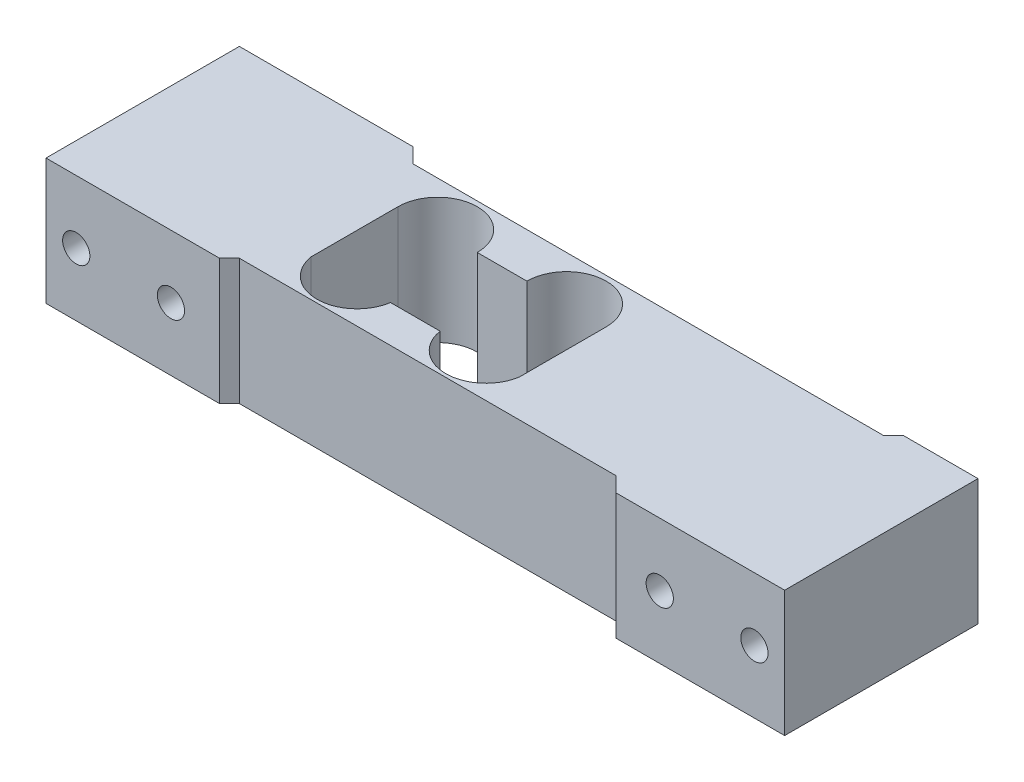
ISO-10303-21;
HEADER;
FILE_DESCRIPTION(('STEP AP214'),'2;1');
FILE_NAME('part.step','',(''),(''),'','','');
FILE_SCHEMA(('AUTOMOTIVE_DESIGN { 1 0 10303 214 1 1 1 1 }'));
ENDSEC;
DATA;
#1=APPLICATION_CONTEXT('core data for automotive mechanical design processes');
#2=APPLICATION_PROTOCOL_DEFINITION('international standard','automotive_design',2000,#1);
#3=PRODUCT_CONTEXT('',#1,'mechanical');
#4=PRODUCT('Part','Part','',(#3));
#5=PRODUCT_RELATED_PRODUCT_CATEGORY('part','',(#4));
#6=PRODUCT_DEFINITION_FORMATION('','',#4);
#7=PRODUCT_DEFINITION_CONTEXT('part definition',#1,'design');
#8=PRODUCT_DEFINITION('design','',#6,#7);
#9=PRODUCT_DEFINITION_SHAPE('','',#8);
#10=(LENGTH_UNIT() NAMED_UNIT(*) SI_UNIT(.MILLI.,.METRE.));
#11=(NAMED_UNIT(*) PLANE_ANGLE_UNIT() SI_UNIT($,.RADIAN.));
#12=(NAMED_UNIT(*) SI_UNIT($,.STERADIAN.) SOLID_ANGLE_UNIT());
#13=UNCERTAINTY_MEASURE_WITH_UNIT(LENGTH_MEASURE(1.E-05),#10,'distance_accuracy_value','');
#14=(GEOMETRIC_REPRESENTATION_CONTEXT(3) GLOBAL_UNCERTAINTY_ASSIGNED_CONTEXT((#13)) GLOBAL_UNIT_ASSIGNED_CONTEXT((#10,
#11,#12)) REPRESENTATION_CONTEXT('',''));
#15=CARTESIAN_POINT('',(0.,0.,0.));
#16=DIRECTION('',(0.,0.,1.));
#17=DIRECTION('',(1.,0.,0.));
#18=AXIS2_PLACEMENT_3D('',#15,#16,#17);
#19=CARTESIAN_POINT('',(-59.,12.7,9.05));
#20=DIRECTION('',(-1.,0.,0.));
#21=DIRECTION('',(0.,0.,1.));
#22=AXIS2_PLACEMENT_3D('',#19,#20,#21);
#23=CYLINDRICAL_SURFACE('',#22,2.75);
#24=CARTESIAN_POINT('',(-75.,12.7,9.05));
#25=DIRECTION('',(-1.,0.,0.));
#26=DIRECTION('',(0.,0.,1.));
#27=AXIS2_PLACEMENT_3D('',#24,#25,#26);
#28=CIRCLE('',#27,2.75);
#29=CARTESIAN_POINT('',(-75.,12.7,11.8));
#30=VERTEX_POINT('',#29);
#31=EDGE_CURVE('E386',#30,#30,#28,.T.);
#32=ORIENTED_EDGE('',*,*,#31,.T.);
#33=EDGE_LOOP('',(#32));
#34=FACE_BOUND('',#33,.T.);
#35=CARTESIAN_POINT('',(-68.9,12.7,9.05));
#36=DIRECTION('',(-0.707106781186547,0.,-0.707106781186547));
#37=DIRECTION('',(-0.707106781186547,0.,0.707106781186547));
#38=AXIS2_PLACEMENT_3D('',#35,#36,#37);
#39=ELLIPSE('',#38,3.88908729652602,2.75);
#40=CARTESIAN_POINT('',(-68.9,15.45,9.05));
#41=VERTEX_POINT('',#40);
#42=CARTESIAN_POINT('',(-68.9,9.95,9.05));
#43=VERTEX_POINT('',#42);
#44=EDGE_CURVE('E47',#41,#43,#39,.F.);
#45=ORIENTED_EDGE('',*,*,#44,.T.);
#46=CARTESIAN_POINT('',(-68.9,12.7,9.05));
#47=DIRECTION('',(-0.707106781186547,0.,0.707106781186547));
#48=DIRECTION('',(-0.707106781186547,0.,-0.707106781186547));
#49=AXIS2_PLACEMENT_3D('',#46,#47,#48);
#50=ELLIPSE('',#49,3.88908729652602,2.75);
#51=EDGE_CURVE('E11',#43,#41,#50,.F.);
#52=ORIENTED_EDGE('',*,*,#51,.T.);
#53=EDGE_LOOP('',(#45,#52));
#54=FACE_BOUND('',#53,.T.);
#55=ADVANCED_FACE('F34',(#34,#54),#23,.F.);
#56=CARTESIAN_POINT('',(-68.9,12.7,-4.));
#57=DIRECTION('',(0.,0.,-1.));
#58=DIRECTION('',(-1.,0.,0.));
#59=AXIS2_PLACEMENT_3D('',#56,#57,#58);
#60=CYLINDRICAL_SURFACE('',#59,2.75000000000001);
#61=CARTESIAN_POINT('',(-68.9,12.7,-20.));
#62=DIRECTION('',(0.,0.,-1.));
#63=DIRECTION('',(-1.,0.,0.));
#64=AXIS2_PLACEMENT_3D('',#61,#62,#63);
#65=CIRCLE('',#64,2.75000000000001);
#66=CARTESIAN_POINT('',(-71.65,12.7,-20.));
#67=VERTEX_POINT('',#66);
#68=EDGE_CURVE('E374',#67,#67,#65,.T.);
#69=ORIENTED_EDGE('',*,*,#68,.T.);
#70=EDGE_LOOP('',(#69));
#71=FACE_BOUND('',#70,.T.);
#72=CARTESIAN_POINT('',(-68.9,12.7,-10.05));
#73=DIRECTION('',(0.707106781186547,0.,-0.707106781186547));
#74=DIRECTION('',(-0.707106781186547,0.,-0.707106781186547));
#75=AXIS2_PLACEMENT_3D('',#72,#73,#74);
#76=ELLIPSE('',#75,3.88908729652602,2.75);
#77=CARTESIAN_POINT('',(-68.9,15.45,-10.05));
#78=VERTEX_POINT('',#77);
#79=CARTESIAN_POINT('',(-68.9,9.95,-10.05));
#80=VERTEX_POINT('',#79);
#81=EDGE_CURVE('E54',#78,#80,#76,.F.);
#82=ORIENTED_EDGE('',*,*,#81,.T.);
#83=CARTESIAN_POINT('',(-68.9,12.7,-10.05));
#84=DIRECTION('',(-0.707106781186547,0.,-0.707106781186547));
#85=DIRECTION('',(0.707106781186547,0.,-0.707106781186547));
#86=AXIS2_PLACEMENT_3D('',#83,#84,#85);
#87=ELLIPSE('',#86,3.88908729652602,2.75);
#88=EDGE_CURVE('E191',#80,#78,#87,.F.);
#89=ORIENTED_EDGE('',*,*,#88,.T.);
#90=EDGE_LOOP('',(#82,#89));
#91=FACE_BOUND('',#90,.T.);
#92=ADVANCED_FACE('F487',(#71,#91),#60,.F.);
#93=CARTESIAN_POINT('',(75.,25.4,-20.));
#94=DIRECTION('',(-1.,0.,0.));
#95=DIRECTION('',(0.,0.,1.));
#96=AXIS2_PLACEMENT_3D('',#93,#94,#95);
#97=PLANE('',#96);
#98=DIRECTION('',(0.,0.,-1.));
#99=VECTOR('',#98,1.);
#100=CARTESIAN_POINT('',(75.,0.,-20.));
#101=LINE('',#100,#99);
#102=CARTESIAN_POINT('',(75.,0.,20.));
#103=VERTEX_POINT('',#102);
#104=CARTESIAN_POINT('',(75.,0.,-19.));
#105=VERTEX_POINT('',#104);
#106=EDGE_CURVE('E263',#103,#105,#101,.T.);
#107=ORIENTED_EDGE('',*,*,#106,.T.);
#108=DIRECTION('',(0.,1.,0.));
#109=VECTOR('',#108,1.);
#110=CARTESIAN_POINT('',(75.,0.,-19.));
#111=LINE('',#110,#109);
#112=CARTESIAN_POINT('',(75.,25.4,-19.));
#113=VERTEX_POINT('',#112);
#114=EDGE_CURVE('E266',#105,#113,#111,.T.);
#115=ORIENTED_EDGE('',*,*,#114,.T.);
#116=DIRECTION('',(0.,0.,-1.));
#117=VECTOR('',#116,1.);
#118=CARTESIAN_POINT('',(75.,25.4,-20.));
#119=LINE('',#118,#117);
#120=CARTESIAN_POINT('',(75.,25.4,20.));
#121=VERTEX_POINT('',#120);
#122=EDGE_CURVE('E257',#121,#113,#119,.T.);
#123=ORIENTED_EDGE('',*,*,#122,.F.);
#124=DIRECTION('',(0.,-1.,0.));
#125=VECTOR('',#124,1.);
#126=CARTESIAN_POINT('',(75.,25.4,20.));
#127=LINE('',#126,#125);
#128=EDGE_CURVE('E251',#121,#103,#127,.T.);
#129=ORIENTED_EDGE('',*,*,#128,.T.);
#130=EDGE_LOOP('',(#107,#115,#123,#129));
#131=FACE_BOUND('',#130,.T.);
#132=ADVANCED_FACE('F474',(#131),#97,.F.);
#133=CARTESIAN_POINT('',(-75.,25.4,-20.));
#134=DIRECTION('',(0.,0.,1.));
#135=DIRECTION('',(1.,0.,0.));
#136=AXIS2_PLACEMENT_3D('',#133,#134,#135);
#137=PLANE('',#136);
#138=ORIENTED_EDGE('',*,*,#68,.F.);
#139=EDGE_LOOP('',(#138));
#140=FACE_BOUND('',#139,.T.);
#141=CARTESIAN_POINT('',(-49.8,12.7,-20.));
#142=DIRECTION('',(0.,0.,-1.));
#143=DIRECTION('',(-1.,0.,0.));
#144=AXIS2_PLACEMENT_3D('',#141,#142,#143);
#145=CIRCLE('',#144,2.75);
#146=CARTESIAN_POINT('',(-52.55,12.7,-20.));
#147=VERTEX_POINT('',#146);
#148=EDGE_CURVE('E367',#147,#147,#145,.T.);
#149=ORIENTED_EDGE('',*,*,#148,.F.);
#150=EDGE_LOOP('',(#149));
#151=FACE_BOUND('',#150,.T.);
#152=DIRECTION('',(-1.,0.,0.));
#153=VECTOR('',#152,1.);
#154=CARTESIAN_POINT('',(-75.,25.4,-20.));
#155=LINE('',#154,#153);
#156=CARTESIAN_POINT('',(-39.9999999999999,25.4,-20.));
#157=VERTEX_POINT('',#156);
#158=CARTESIAN_POINT('',(-75.,25.4,-20.));
#159=VERTEX_POINT('',#158);
#160=EDGE_CURVE('E271',#157,#159,#155,.T.);
#161=ORIENTED_EDGE('',*,*,#160,.F.);
#162=DIRECTION('',(0.,1.,0.));
#163=VECTOR('',#162,1.);
#164=CARTESIAN_POINT('',(-39.9999999999999,25.4,-20.));
#165=LINE('',#164,#163);
#166=CARTESIAN_POINT('',(-39.9999999999999,0.,-20.));
#167=VERTEX_POINT('',#166);
#168=EDGE_CURVE('E228',#157,#167,#165,.F.);
#169=ORIENTED_EDGE('',*,*,#168,.T.);
#170=DIRECTION('',(-1.,0.,0.));
#171=VECTOR('',#170,1.);
#172=CARTESIAN_POINT('',(-75.,0.,-20.));
#173=LINE('',#172,#171);
#174=CARTESIAN_POINT('',(-75.,0.,-20.));
#175=VERTEX_POINT('',#174);
#176=EDGE_CURVE('E261',#167,#175,#173,.T.);
#177=ORIENTED_EDGE('',*,*,#176,.T.);
#178=DIRECTION('',(0.,-1.,0.));
#179=VECTOR('',#178,1.);
#180=CARTESIAN_POINT('',(-75.,25.4,-20.));
#181=LINE('',#180,#179);
#182=EDGE_CURVE('E248',#159,#175,#181,.T.);
#183=ORIENTED_EDGE('',*,*,#182,.F.);
#184=EDGE_LOOP('',(#161,#169,#177,#183));
#185=FACE_BOUND('',#184,.T.);
#186=ADVANCED_FACE('F458',(#140,#151,#185),#137,.F.);
#187=CARTESIAN_POINT('',(-75.,25.4,-20.));
#188=DIRECTION('',(1.,0.,0.));
#189=DIRECTION('',(0.,0.,-1.));
#190=AXIS2_PLACEMENT_3D('',#187,#188,#189);
#191=PLANE('',#190);
#192=ORIENTED_EDGE('',*,*,#31,.F.);
#193=EDGE_LOOP('',(#192));
#194=FACE_BOUND('',#193,.T.);
#195=CARTESIAN_POINT('',(-75.,12.7,-10.05));
#196=DIRECTION('',(-1.,0.,0.));
#197=DIRECTION('',(0.,0.,1.));
#198=AXIS2_PLACEMENT_3D('',#195,#196,#197);
#199=CIRCLE('',#198,2.75);
#200=CARTESIAN_POINT('',(-75.,12.7,-7.3));
#201=VERTEX_POINT('',#200);
#202=EDGE_CURVE('E379',#201,#201,#199,.T.);
#203=ORIENTED_EDGE('',*,*,#202,.F.);
#204=EDGE_LOOP('',(#203));
#205=FACE_BOUND('',#204,.T.);
#206=DIRECTION('',(0.,0.,1.));
#207=VECTOR('',#206,1.);
#208=CARTESIAN_POINT('',(-75.,0.,-20.));
#209=LINE('',#208,#207);
#210=CARTESIAN_POINT('',(-75.,0.,19.));
#211=VERTEX_POINT('',#210);
#212=EDGE_CURVE('E258',#175,#211,#209,.T.);
#213=ORIENTED_EDGE('',*,*,#212,.T.);
#214=DIRECTION('',(0.,1.,0.));
#215=VECTOR('',#214,1.);
#216=CARTESIAN_POINT('',(-75.,0.,19.));
#217=LINE('',#216,#215);
#218=CARTESIAN_POINT('',(-75.,25.4,19.));
#219=VERTEX_POINT('',#218);
#220=EDGE_CURVE('E275',#211,#219,#217,.T.);
#221=ORIENTED_EDGE('',*,*,#220,.T.);
#222=DIRECTION('',(0.,0.,1.));
#223=VECTOR('',#222,1.);
#224=CARTESIAN_POINT('',(-75.,25.4,-20.));
#225=LINE('',#224,#223);
#226=EDGE_CURVE('E268',#159,#219,#225,.T.);
#227=ORIENTED_EDGE('',*,*,#226,.F.);
#228=ORIENTED_EDGE('',*,*,#182,.T.);
#229=EDGE_LOOP('',(#213,#221,#227,#228));
#230=FACE_BOUND('',#229,.T.);
#231=ADVANCED_FACE('F428',(#194,#205,#230),#191,.F.);
#232=CARTESIAN_POINT('',(-75.,25.4,20.));
#233=DIRECTION('',(0.,0.,-1.));
#234=DIRECTION('',(-1.,0.,0.));
#235=AXIS2_PLACEMENT_3D('',#232,#233,#234);
#236=PLANE('',#235);
#237=CARTESIAN_POINT('',(49.8,12.7,20.));
#238=DIRECTION('',(0.,0.,1.));
#239=DIRECTION('',(1.,0.,0.));
#240=AXIS2_PLACEMENT_3D('',#237,#238,#239);
#241=CIRCLE('',#240,2.75);
#242=CARTESIAN_POINT('',(52.55,12.7,20.));
#243=VERTEX_POINT('',#242);
#244=EDGE_CURVE('E409',#243,#243,#241,.T.);
#245=ORIENTED_EDGE('',*,*,#244,.F.);
#246=EDGE_LOOP('',(#245));
#247=FACE_BOUND('',#246,.T.);
#248=CARTESIAN_POINT('',(68.9,12.7,20.));
#249=DIRECTION('',(0.,0.,1.));
#250=DIRECTION('',(1.,0.,0.));
#251=AXIS2_PLACEMENT_3D('',#248,#249,#250);
#252=CIRCLE('',#251,2.75000000000001);
#253=CARTESIAN_POINT('',(71.65,12.7,20.));
#254=VERTEX_POINT('',#253);
#255=EDGE_CURVE('E403',#254,#254,#252,.T.);
#256=ORIENTED_EDGE('',*,*,#255,.F.);
#257=EDGE_LOOP('',(#256));
#258=FACE_BOUND('',#257,.T.);
#259=DIRECTION('',(1.,0.,0.));
#260=VECTOR('',#259,1.);
#261=CARTESIAN_POINT('',(-75.,25.4,20.));
#262=LINE('',#261,#260);
#263=CARTESIAN_POINT('',(40.9999999999999,25.4,20.));
#264=VERTEX_POINT('',#263);
#265=EDGE_CURVE('E254',#264,#121,#262,.T.);
#266=ORIENTED_EDGE('',*,*,#265,.F.);
#267=DIRECTION('',(0.,1.,0.));
#268=VECTOR('',#267,1.);
#269=CARTESIAN_POINT('',(40.9999999999999,25.4,20.));
#270=LINE('',#269,#268);
#271=CARTESIAN_POINT('',(40.9999999999999,0.,20.));
#272=VERTEX_POINT('',#271);
#273=EDGE_CURVE('E236',#264,#272,#270,.F.);
#274=ORIENTED_EDGE('',*,*,#273,.T.);
#275=DIRECTION('',(1.,0.,0.));
#276=VECTOR('',#275,1.);
#277=CARTESIAN_POINT('',(-75.,0.,20.));
#278=LINE('',#277,#276);
#279=EDGE_CURVE('E255',#272,#103,#278,.T.);
#280=ORIENTED_EDGE('',*,*,#279,.T.);
#281=ORIENTED_EDGE('',*,*,#128,.F.);
#282=EDGE_LOOP('',(#266,#274,#280,#281));
#283=FACE_BOUND('',#282,.T.);
#284=ADVANCED_FACE('F424',(#247,#258,#283),#236,.F.);
#285=CARTESIAN_POINT('',(0.,25.4,0.));
#286=DIRECTION('',(0.,1.,0.));
#287=DIRECTION('',(0.,0.,1.));
#288=AXIS2_PLACEMENT_3D('',#285,#286,#287);
#289=PLANE('',#288);
#290=CARTESIAN_POINT('',(3.00000000000001,25.4,-8.));
#291=DIRECTION('',(0.,1.,0.));
#292=DIRECTION('',(0.,0.,1.));
#293=AXIS2_PLACEMENT_3D('',#290,#291,#292);
#294=CIRCLE('',#293,7.99999999999999);
#295=CARTESIAN_POINT('',(11.,25.4,-8.));
#296=VERTEX_POINT('',#295);
#297=CARTESIAN_POINT('',(-4.99999999999999,25.4,-8.));
#298=VERTEX_POINT('',#297);
#299=EDGE_CURVE('E342',#296,#298,#294,.T.);
#300=ORIENTED_EDGE('',*,*,#299,.F.);
#301=DIRECTION('',(0.,0.,-1.));
#302=VECTOR('',#301,1.);
#303=CARTESIAN_POINT('',(11.,25.4,9.5));
#304=LINE('',#303,#302);
#305=CARTESIAN_POINT('',(11.,25.4,9.50000000000001));
#306=VERTEX_POINT('',#305);
#307=EDGE_CURVE('E320',#306,#296,#304,.T.);
#308=ORIENTED_EDGE('',*,*,#307,.F.);
#309=CARTESIAN_POINT('',(3.00000000000001,25.4,8.2527426));
#310=DIRECTION('',(0.,1.,0.));
#311=DIRECTION('',(0.,0.,1.));
#312=AXIS2_PLACEMENT_3D('',#309,#310,#311);
#313=CIRCLE('',#312,8.09664442975328);
#314=CARTESIAN_POINT('',(-4.99999999999999,25.4,9.5));
#315=VERTEX_POINT('',#314);
#316=EDGE_CURVE('E324',#315,#306,#313,.T.);
#317=ORIENTED_EDGE('',*,*,#316,.F.);
#318=DIRECTION('',(1.,0.,0.));
#319=VECTOR('',#318,1.);
#320=CARTESIAN_POINT('',(-15.,25.4,9.5));
#321=LINE('',#320,#319);
#322=CARTESIAN_POINT('',(-15.,25.4,9.50000000000001));
#323=VERTEX_POINT('',#322);
#324=EDGE_CURVE('E327',#323,#315,#321,.T.);
#325=ORIENTED_EDGE('',*,*,#324,.F.);
#326=CARTESIAN_POINT('',(-23.,25.4,8.25274262759437));
#327=DIRECTION('',(0.,1.,0.));
#328=DIRECTION('',(0.,0.,1.));
#329=AXIS2_PLACEMENT_3D('',#326,#327,#328);
#330=CIRCLE('',#329,8.09664442550247);
#331=CARTESIAN_POINT('',(-31.,25.4,9.5));
#332=VERTEX_POINT('',#331);
#333=EDGE_CURVE('E330',#332,#323,#330,.T.);
#334=ORIENTED_EDGE('',*,*,#333,.F.);
#335=DIRECTION('',(0.,0.,1.));
#336=VECTOR('',#335,1.);
#337=CARTESIAN_POINT('',(-31.,25.4,-8.));
#338=LINE('',#337,#336);
#339=CARTESIAN_POINT('',(-31.,25.4,-8.));
#340=VERTEX_POINT('',#339);
#341=EDGE_CURVE('E333',#340,#332,#338,.T.);
#342=ORIENTED_EDGE('',*,*,#341,.F.);
#343=CARTESIAN_POINT('',(-23.,25.4,-8.));
#344=DIRECTION('',(0.,1.,0.));
#345=DIRECTION('',(0.,0.,1.));
#346=AXIS2_PLACEMENT_3D('',#343,#344,#345);
#347=CIRCLE('',#346,8.);
#348=CARTESIAN_POINT('',(-15.,25.4,-8.));
#349=VERTEX_POINT('',#348);
#350=EDGE_CURVE('E336',#349,#340,#347,.T.);
#351=ORIENTED_EDGE('',*,*,#350,.F.);
#352=DIRECTION('',(-1.,0.,0.));
#353=VECTOR('',#352,1.);
#354=CARTESIAN_POINT('',(-15.,25.4,-8.));
#355=LINE('',#354,#353);
#356=EDGE_CURVE('E339',#298,#349,#355,.T.);
#357=ORIENTED_EDGE('',*,*,#356,.F.);
#358=EDGE_LOOP('',(#300,#308,#317,#325,#334,#342,#351,#357));
#359=FACE_BOUND('',#358,.T.);
#360=DIRECTION('',(1.,0.,0.));
#361=VECTOR('',#360,1.);
#362=CARTESIAN_POINT('',(61.,25.4,-19.));
#363=LINE('',#362,#361);
#364=CARTESIAN_POINT('',(60.,25.4,-19.));
#365=VERTEX_POINT('',#364);
#366=EDGE_CURVE('E294',#365,#113,#363,.T.);
#367=ORIENTED_EDGE('',*,*,#366,.F.);
#368=DIRECTION('',(0.707106781186543,0.,-0.707106781186552));
#369=VECTOR('',#368,1.);
#370=CARTESIAN_POINT('',(61.,25.4,-20.0000000000001));
#371=LINE('',#370,#369);
#372=CARTESIAN_POINT('',(58.,25.4,-17.));
#373=VERTEX_POINT('',#372);
#374=EDGE_CURVE('E207',#365,#373,#371,.F.);
#375=ORIENTED_EDGE('',*,*,#374,.T.);
#376=DIRECTION('',(1.,0.,0.));
#377=VECTOR('',#376,1.);
#378=CARTESIAN_POINT('',(-42.,25.4,-17.));
#379=LINE('',#378,#377);
#380=CARTESIAN_POINT('',(-36.9999999999999,25.4,-17.));
#381=VERTEX_POINT('',#380);
#382=EDGE_CURVE('E278',#381,#373,#379,.T.);
#383=ORIENTED_EDGE('',*,*,#382,.F.);
#384=DIRECTION('',(0.707106781186551,0.,0.707106781186544));
#385=VECTOR('',#384,1.);
#386=CARTESIAN_POINT('',(-36.9999999999999,25.4,-17.));
#387=LINE('',#386,#385);
#388=EDGE_CURVE('E231',#381,#157,#387,.F.);
#389=ORIENTED_EDGE('',*,*,#388,.T.);
#390=ORIENTED_EDGE('',*,*,#160,.T.);
#391=ORIENTED_EDGE('',*,*,#226,.T.);
#392=DIRECTION('',(-1.,0.,0.));
#393=VECTOR('',#392,1.);
#394=CARTESIAN_POINT('',(-41.,25.4,19.));
#395=LINE('',#394,#393);
#396=CARTESIAN_POINT('',(-39.9999999999999,25.4,19.));
#397=VERTEX_POINT('',#396);
#398=EDGE_CURVE('E280',#397,#219,#395,.T.);
#399=ORIENTED_EDGE('',*,*,#398,.F.);
#400=DIRECTION('',(-0.707106781186545,0.,0.70710678118655));
#401=VECTOR('',#400,1.);
#402=CARTESIAN_POINT('',(-41.,25.4,20.0000000000001));
#403=LINE('',#402,#401);
#404=CARTESIAN_POINT('',(-38.,25.4,17.));
#405=VERTEX_POINT('',#404);
#406=EDGE_CURVE('E215',#397,#405,#403,.F.);
#407=ORIENTED_EDGE('',*,*,#406,.T.);
#408=DIRECTION('',(-1.,0.,0.));
#409=VECTOR('',#408,1.);
#410=CARTESIAN_POINT('',(43.,25.4,17.));
#411=LINE('',#410,#409);
#412=CARTESIAN_POINT('',(37.9999999999999,25.4,17.));
#413=VERTEX_POINT('',#412);
#414=EDGE_CURVE('E283',#413,#405,#411,.T.);
#415=ORIENTED_EDGE('',*,*,#414,.F.);
#416=DIRECTION('',(-0.707106781186551,0.,-0.707106781186544));
#417=VECTOR('',#416,1.);
#418=CARTESIAN_POINT('',(37.9999999999999,25.4,17.));
#419=LINE('',#418,#417);
#420=EDGE_CURVE('E239',#413,#264,#419,.F.);
#421=ORIENTED_EDGE('',*,*,#420,.T.);
#422=ORIENTED_EDGE('',*,*,#265,.T.);
#423=ORIENTED_EDGE('',*,*,#122,.T.);
#424=EDGE_LOOP('',(#367,#375,#383,#389,#390,#391,#399,#407,#415,#421,#422,#423));
#425=FACE_BOUND('',#424,.T.);
#426=ADVANCED_FACE('F427',(#359,#425),#289,.T.);
#427=CARTESIAN_POINT('',(0.,0.,0.));
#428=DIRECTION('',(0.,1.,0.));
#429=DIRECTION('',(0.,0.,1.));
#430=AXIS2_PLACEMENT_3D('',#427,#428,#429);
#431=PLANE('',#430);
#432=DIRECTION('',(0.,0.,-1.));
#433=VECTOR('',#432,1.);
#434=CARTESIAN_POINT('',(11.,0.,9.5));
#435=LINE('',#434,#433);
#436=CARTESIAN_POINT('',(11.,0.,9.50000000000001));
#437=VERTEX_POINT('',#436);
#438=CARTESIAN_POINT('',(11.,0.,-8.));
#439=VERTEX_POINT('',#438);
#440=EDGE_CURVE('E307',#437,#439,#435,.T.);
#441=ORIENTED_EDGE('',*,*,#440,.T.);
#442=CARTESIAN_POINT('',(3.00000000000001,0.,-8.));
#443=DIRECTION('',(0.,1.,0.));
#444=DIRECTION('',(0.,0.,1.));
#445=AXIS2_PLACEMENT_3D('',#442,#443,#444);
#446=CIRCLE('',#445,7.99999999999999);
#447=CARTESIAN_POINT('',(-4.99999999999999,0.,-8.));
#448=VERTEX_POINT('',#447);
#449=EDGE_CURVE('E323',#439,#448,#446,.T.);
#450=ORIENTED_EDGE('',*,*,#449,.T.);
#451=DIRECTION('',(-1.,0.,0.));
#452=VECTOR('',#451,1.);
#453=CARTESIAN_POINT('',(-15.,0.,-8.));
#454=LINE('',#453,#452);
#455=CARTESIAN_POINT('',(-15.,0.,-8.));
#456=VERTEX_POINT('',#455);
#457=EDGE_CURVE('E362',#448,#456,#454,.T.);
#458=ORIENTED_EDGE('',*,*,#457,.T.);
#459=CARTESIAN_POINT('',(-23.,0.,-8.));
#460=DIRECTION('',(0.,1.,0.));
#461=DIRECTION('',(0.,0.,1.));
#462=AXIS2_PLACEMENT_3D('',#459,#460,#461);
#463=CIRCLE('',#462,8.);
#464=CARTESIAN_POINT('',(-31.,0.,-8.));
#465=VERTEX_POINT('',#464);
#466=EDGE_CURVE('E359',#456,#465,#463,.T.);
#467=ORIENTED_EDGE('',*,*,#466,.T.);
#468=DIRECTION('',(0.,0.,1.));
#469=VECTOR('',#468,1.);
#470=CARTESIAN_POINT('',(-31.,0.,-8.));
#471=LINE('',#470,#469);
#472=CARTESIAN_POINT('',(-31.,0.,9.5));
#473=VERTEX_POINT('',#472);
#474=EDGE_CURVE('E356',#465,#473,#471,.T.);
#475=ORIENTED_EDGE('',*,*,#474,.T.);
#476=CARTESIAN_POINT('',(-23.,0.,8.25274262759437));
#477=DIRECTION('',(0.,1.,0.));
#478=DIRECTION('',(0.,0.,1.));
#479=AXIS2_PLACEMENT_3D('',#476,#477,#478);
#480=CIRCLE('',#479,8.09664442550247);
#481=CARTESIAN_POINT('',(-15.,0.,9.50000000000001));
#482=VERTEX_POINT('',#481);
#483=EDGE_CURVE('E353',#473,#482,#480,.T.);
#484=ORIENTED_EDGE('',*,*,#483,.T.);
#485=DIRECTION('',(1.,0.,0.));
#486=VECTOR('',#485,1.);
#487=CARTESIAN_POINT('',(-15.,0.,9.5));
#488=LINE('',#487,#486);
#489=CARTESIAN_POINT('',(-4.99999999999999,0.,9.5));
#490=VERTEX_POINT('',#489);
#491=EDGE_CURVE('E350',#482,#490,#488,.T.);
#492=ORIENTED_EDGE('',*,*,#491,.T.);
#493=CARTESIAN_POINT('',(3.00000000000001,0.,8.2527426));
#494=DIRECTION('',(0.,1.,0.));
#495=DIRECTION('',(0.,0.,1.));
#496=AXIS2_PLACEMENT_3D('',#493,#494,#495);
#497=CIRCLE('',#496,8.09664442975328);
#498=EDGE_CURVE('E347',#490,#437,#497,.T.);
#499=ORIENTED_EDGE('',*,*,#498,.T.);
#500=EDGE_LOOP('',(#441,#450,#458,#467,#475,#484,#492,#499));
#501=FACE_BOUND('',#500,.T.);
#502=DIRECTION('',(1.,0.,0.));
#503=VECTOR('',#502,1.);
#504=CARTESIAN_POINT('',(-42.,0.,-17.));
#505=LINE('',#504,#503);
#506=CARTESIAN_POINT('',(-36.9999999999999,0.,-17.));
#507=VERTEX_POINT('',#506);
#508=CARTESIAN_POINT('',(58.,0.,-17.));
#509=VERTEX_POINT('',#508);
#510=EDGE_CURVE('E296',#507,#509,#505,.T.);
#511=ORIENTED_EDGE('',*,*,#510,.T.);
#512=DIRECTION('',(-0.707106781186543,0.,0.707106781186552));
#513=VECTOR('',#512,1.);
#514=CARTESIAN_POINT('',(20.5000000000003,0.,20.5000000000001));
#515=LINE('',#514,#513);
#516=CARTESIAN_POINT('',(60.,0.,-19.));
#517=VERTEX_POINT('',#516);
#518=EDGE_CURVE('E204',#509,#517,#515,.F.);
#519=ORIENTED_EDGE('',*,*,#518,.T.);
#520=DIRECTION('',(1.,0.,0.));
#521=VECTOR('',#520,1.);
#522=CARTESIAN_POINT('',(61.,0.,-19.));
#523=LINE('',#522,#521);
#524=EDGE_CURVE('E293',#517,#105,#523,.T.);
#525=ORIENTED_EDGE('',*,*,#524,.T.);
#526=ORIENTED_EDGE('',*,*,#106,.F.);
#527=ORIENTED_EDGE('',*,*,#279,.F.);
#528=DIRECTION('',(0.707106781186551,0.,0.707106781186544));
#529=VECTOR('',#528,1.);
#530=CARTESIAN_POINT('',(10.4999999999998,0.,-10.4999999999999));
#531=LINE('',#530,#529);
#532=CARTESIAN_POINT('',(37.9999999999999,0.,17.));
#533=VERTEX_POINT('',#532);
#534=EDGE_CURVE('E234',#272,#533,#531,.F.);
#535=ORIENTED_EDGE('',*,*,#534,.T.);
#536=DIRECTION('',(-1.,0.,0.));
#537=VECTOR('',#536,1.);
#538=CARTESIAN_POINT('',(43.,0.,17.));
#539=LINE('',#538,#537);
#540=CARTESIAN_POINT('',(-38.,0.,17.));
#541=VERTEX_POINT('',#540);
#542=EDGE_CURVE('E282',#533,#541,#539,.T.);
#543=ORIENTED_EDGE('',*,*,#542,.T.);
#544=DIRECTION('',(0.707106781186545,0.,-0.70710678118655));
#545=VECTOR('',#544,1.);
#546=CARTESIAN_POINT('',(-10.5000000000001,0.,-10.5));
#547=LINE('',#546,#545);
#548=CARTESIAN_POINT('',(-39.9999999999999,0.,19.));
#549=VERTEX_POINT('',#548);
#550=EDGE_CURVE('E212',#541,#549,#547,.F.);
#551=ORIENTED_EDGE('',*,*,#550,.T.);
#552=DIRECTION('',(-1.,0.,0.));
#553=VECTOR('',#552,1.);
#554=CARTESIAN_POINT('',(-41.,0.,19.));
#555=LINE('',#554,#553);
#556=EDGE_CURVE('E279',#549,#211,#555,.T.);
#557=ORIENTED_EDGE('',*,*,#556,.T.);
#558=ORIENTED_EDGE('',*,*,#212,.F.);
#559=ORIENTED_EDGE('',*,*,#176,.F.);
#560=DIRECTION('',(-0.707106781186551,0.,-0.707106781186544));
#561=VECTOR('',#560,1.);
#562=CARTESIAN_POINT('',(-9.99999999999976,0.,9.99999999999986));
#563=LINE('',#562,#561);
#564=EDGE_CURVE('E226',#167,#507,#563,.F.);
#565=ORIENTED_EDGE('',*,*,#564,.T.);
#566=EDGE_LOOP('',(#511,#519,#525,#526,#527,#535,#543,#551,#557,#558,#559,#565));
#567=FACE_BOUND('',#566,.T.);
#568=ADVANCED_FACE('F443',(#501,#567),#431,.F.);
#569=CARTESIAN_POINT('',(-41.,0.,19.));
#570=DIRECTION('',(0.,0.,-1.));
#571=DIRECTION('',(-1.,0.,0.));
#572=AXIS2_PLACEMENT_3D('',#569,#570,#571);
#573=PLANE('',#572);
#574=CARTESIAN_POINT('',(-68.9,12.7,19.));
#575=DIRECTION('',(0.,0.,1.));
#576=DIRECTION('',(1.,0.,0.));
#577=AXIS2_PLACEMENT_3D('',#574,#575,#576);
#578=CIRCLE('',#577,2.75000000000001);
#579=CARTESIAN_POINT('',(-66.15,12.7,19.));
#580=VERTEX_POINT('',#579);
#581=EDGE_CURVE('E398',#580,#580,#578,.T.);
#582=ORIENTED_EDGE('',*,*,#581,.F.);
#583=EDGE_LOOP('',(#582));
#584=FACE_BOUND('',#583,.T.);
#585=CARTESIAN_POINT('',(-49.8,12.7,19.));
#586=DIRECTION('',(0.,0.,1.));
#587=DIRECTION('',(1.,0.,0.));
#588=AXIS2_PLACEMENT_3D('',#585,#586,#587);
#589=CIRCLE('',#588,2.75);
#590=CARTESIAN_POINT('',(-47.05,12.7,19.));
#591=VERTEX_POINT('',#590);
#592=EDGE_CURVE('E391',#591,#591,#589,.T.);
#593=ORIENTED_EDGE('',*,*,#592,.F.);
#594=EDGE_LOOP('',(#593));
#595=FACE_BOUND('',#594,.T.);
#596=ORIENTED_EDGE('',*,*,#398,.T.);
#597=ORIENTED_EDGE('',*,*,#220,.F.);
#598=ORIENTED_EDGE('',*,*,#556,.F.);
#599=DIRECTION('',(0.,-1.,0.));
#600=VECTOR('',#599,1.);
#601=CARTESIAN_POINT('',(-39.9999999999999,0.,19.));
#602=LINE('',#601,#600);
#603=EDGE_CURVE('E217',#549,#397,#602,.F.);
#604=ORIENTED_EDGE('',*,*,#603,.T.);
#605=EDGE_LOOP('',(#596,#597,#598,#604));
#606=FACE_BOUND('',#605,.T.);
#607=ADVANCED_FACE('F483',(#584,#595,#606),#573,.F.);
#608=CARTESIAN_POINT('',(43.,0.,17.));
#609=DIRECTION('',(0.,0.,-1.));
#610=DIRECTION('',(-1.,0.,0.));
#611=AXIS2_PLACEMENT_3D('',#608,#609,#610);
#612=PLANE('',#611);
#613=ORIENTED_EDGE('',*,*,#414,.T.);
#614=DIRECTION('',(0.,-1.,0.));
#615=VECTOR('',#614,1.);
#616=CARTESIAN_POINT('',(-38.,0.,17.));
#617=LINE('',#616,#615);
#618=EDGE_CURVE('E223',#405,#541,#617,.T.);
#619=ORIENTED_EDGE('',*,*,#618,.T.);
#620=ORIENTED_EDGE('',*,*,#542,.F.);
#621=DIRECTION('',(0.,1.,0.));
#622=VECTOR('',#621,1.);
#623=CARTESIAN_POINT('',(37.9999999999999,25.4,17.));
#624=LINE('',#623,#622);
#625=EDGE_CURVE('E245',#533,#413,#624,.T.);
#626=ORIENTED_EDGE('',*,*,#625,.T.);
#627=EDGE_LOOP('',(#613,#619,#620,#626));
#628=FACE_BOUND('',#627,.T.);
#629=ADVANCED_FACE('F446',(#628),#612,.F.);
#630=CARTESIAN_POINT('',(61.,0.,-19.));
#631=DIRECTION('',(0.,0.,1.));
#632=DIRECTION('',(1.,0.,0.));
#633=AXIS2_PLACEMENT_3D('',#630,#631,#632);
#634=PLANE('',#633);
#635=ORIENTED_EDGE('',*,*,#366,.T.);
#636=ORIENTED_EDGE('',*,*,#114,.F.);
#637=ORIENTED_EDGE('',*,*,#524,.F.);
#638=DIRECTION('',(0.,-1.,0.));
#639=VECTOR('',#638,1.);
#640=CARTESIAN_POINT('',(60.,0.,-19.));
#641=LINE('',#640,#639);
#642=EDGE_CURVE('E209',#517,#365,#641,.F.);
#643=ORIENTED_EDGE('',*,*,#642,.T.);
#644=EDGE_LOOP('',(#635,#636,#637,#643));
#645=FACE_BOUND('',#644,.T.);
#646=ADVANCED_FACE('F475',(#645),#634,.F.);
#647=CARTESIAN_POINT('',(-42.,0.,-17.));
#648=DIRECTION('',(0.,0.,1.));
#649=DIRECTION('',(1.,0.,0.));
#650=AXIS2_PLACEMENT_3D('',#647,#648,#649);
#651=PLANE('',#650);
#652=ORIENTED_EDGE('',*,*,#382,.T.);
#653=DIRECTION('',(0.,-1.,0.));
#654=VECTOR('',#653,1.);
#655=CARTESIAN_POINT('',(58.,0.,-17.));
#656=LINE('',#655,#654);
#657=EDGE_CURVE('E220',#373,#509,#656,.T.);
#658=ORIENTED_EDGE('',*,*,#657,.T.);
#659=ORIENTED_EDGE('',*,*,#510,.F.);
#660=DIRECTION('',(0.,1.,0.));
#661=VECTOR('',#660,1.);
#662=CARTESIAN_POINT('',(-36.9999999999999,25.4,-17.));
#663=LINE('',#662,#661);
#664=EDGE_CURVE('E242',#507,#381,#663,.T.);
#665=ORIENTED_EDGE('',*,*,#664,.T.);
#666=EDGE_LOOP('',(#652,#658,#659,#665));
#667=FACE_BOUND('',#666,.T.);
#668=ADVANCED_FACE('F465',(#667),#651,.F.);
#669=CARTESIAN_POINT('',(37.9999999999999,0.,17.));
#670=DIRECTION('',(-0.707106781186544,0.,0.707106781186551));
#671=DIRECTION('',(0.,-1.,0.));
#672=AXIS2_PLACEMENT_3D('',#669,#670,#671);
#673=PLANE('',#672);
#674=ORIENTED_EDGE('',*,*,#534,.F.);
#675=ORIENTED_EDGE('',*,*,#273,.F.);
#676=ORIENTED_EDGE('',*,*,#420,.F.);
#677=ORIENTED_EDGE('',*,*,#625,.F.);
#678=EDGE_LOOP('',(#674,#675,#676,#677));
#679=FACE_BOUND('',#678,.T.);
#680=ADVANCED_FACE('F440',(#679),#673,.T.);
#681=CARTESIAN_POINT('',(-36.9999999999999,0.,-17.));
#682=DIRECTION('',(0.707106781186544,0.,-0.707106781186551));
#683=DIRECTION('',(0.,-1.,0.));
#684=AXIS2_PLACEMENT_3D('',#681,#682,#683);
#685=PLANE('',#684);
#686=ORIENTED_EDGE('',*,*,#564,.F.);
#687=ORIENTED_EDGE('',*,*,#168,.F.);
#688=ORIENTED_EDGE('',*,*,#388,.F.);
#689=ORIENTED_EDGE('',*,*,#664,.F.);
#690=EDGE_LOOP('',(#686,#687,#688,#689));
#691=FACE_BOUND('',#690,.T.);
#692=ADVANCED_FACE('F468',(#691),#685,.T.);
#693=CARTESIAN_POINT('',(-41.,0.,20.0000000000001));
#694=DIRECTION('',(0.70710678118655,0.,0.707106781186545));
#695=DIRECTION('',(0.,-1.,0.));
#696=AXIS2_PLACEMENT_3D('',#693,#694,#695);
#697=PLANE('',#696);
#698=ORIENTED_EDGE('',*,*,#550,.F.);
#699=ORIENTED_EDGE('',*,*,#618,.F.);
#700=ORIENTED_EDGE('',*,*,#406,.F.);
#701=ORIENTED_EDGE('',*,*,#603,.F.);
#702=EDGE_LOOP('',(#698,#699,#700,#701));
#703=FACE_BOUND('',#702,.T.);
#704=ADVANCED_FACE('F450',(#703),#697,.T.);
#705=CARTESIAN_POINT('',(61.,0.,-20.0000000000001));
#706=DIRECTION('',(-0.707106781186552,0.,-0.707106781186543));
#707=DIRECTION('',(0.,-1.,0.));
#708=AXIS2_PLACEMENT_3D('',#705,#706,#707);
#709=PLANE('',#708);
#710=ORIENTED_EDGE('',*,*,#518,.F.);
#711=ORIENTED_EDGE('',*,*,#657,.F.);
#712=ORIENTED_EDGE('',*,*,#374,.F.);
#713=ORIENTED_EDGE('',*,*,#642,.F.);
#714=EDGE_LOOP('',(#710,#711,#712,#713));
#715=FACE_BOUND('',#714,.T.);
#716=ADVANCED_FACE('F36',(#715),#709,.T.);
#717=CARTESIAN_POINT('',(3.00000000000001,0.,-8.));
#718=DIRECTION('',(0.,1.,0.));
#719=DIRECTION('',(0.,0.,1.));
#720=AXIS2_PLACEMENT_3D('',#717,#718,#719);
#721=CYLINDRICAL_SURFACE('',#720,7.99999999999999);
#722=ORIENTED_EDGE('',*,*,#299,.T.);
#723=DIRECTION('',(0.,1.,0.));
#724=VECTOR('',#723,1.);
#725=CARTESIAN_POINT('',(-4.99999999999999,0.,-8.));
#726=LINE('',#725,#724);
#727=EDGE_CURVE('E303',#448,#298,#726,.T.);
#728=ORIENTED_EDGE('',*,*,#727,.F.);
#729=ORIENTED_EDGE('',*,*,#449,.F.);
#730=DIRECTION('',(0.,1.,0.));
#731=VECTOR('',#730,1.);
#732=CARTESIAN_POINT('',(11.,0.,-8.));
#733=LINE('',#732,#731);
#734=EDGE_CURVE('E286',#439,#296,#733,.T.);
#735=ORIENTED_EDGE('',*,*,#734,.T.);
#736=EDGE_LOOP('',(#722,#728,#729,#735));
#737=FACE_BOUND('',#736,.T.);
#738=ADVANCED_FACE('F756',(#737),#721,.F.);
#739=CARTESIAN_POINT('',(11.,0.,9.5));
#740=DIRECTION('',(1.,0.,0.));
#741=DIRECTION('',(0.,0.,-1.));
#742=AXIS2_PLACEMENT_3D('',#739,#740,#741);
#743=PLANE('',#742);
#744=ORIENTED_EDGE('',*,*,#307,.T.);
#745=ORIENTED_EDGE('',*,*,#734,.F.);
#746=ORIENTED_EDGE('',*,*,#440,.F.);
#747=DIRECTION('',(0.,1.,0.));
#748=VECTOR('',#747,1.);
#749=CARTESIAN_POINT('',(11.,0.,9.50000000000001));
#750=LINE('',#749,#748);
#751=EDGE_CURVE('E317',#437,#306,#750,.T.);
#752=ORIENTED_EDGE('',*,*,#751,.T.);
#753=EDGE_LOOP('',(#744,#745,#746,#752));
#754=FACE_BOUND('',#753,.T.);
#755=ADVANCED_FACE('F746',(#754),#743,.F.);
#756=CARTESIAN_POINT('',(3.00000000000001,0.,8.2527426));
#757=DIRECTION('',(0.,1.,0.));
#758=DIRECTION('',(0.,0.,1.));
#759=AXIS2_PLACEMENT_3D('',#756,#757,#758);
#760=CYLINDRICAL_SURFACE('',#759,8.09664442975328);
#761=ORIENTED_EDGE('',*,*,#316,.T.);
#762=ORIENTED_EDGE('',*,*,#751,.F.);
#763=ORIENTED_EDGE('',*,*,#498,.F.);
#764=DIRECTION('',(0.,1.,0.));
#765=VECTOR('',#764,1.);
#766=CARTESIAN_POINT('',(-4.99999999999999,0.,9.5));
#767=LINE('',#766,#765);
#768=EDGE_CURVE('E315',#490,#315,#767,.T.);
#769=ORIENTED_EDGE('',*,*,#768,.T.);
#770=EDGE_LOOP('',(#761,#762,#763,#769));
#771=FACE_BOUND('',#770,.T.);
#772=ADVANCED_FACE('F736',(#771),#760,.F.);
#773=CARTESIAN_POINT('',(-15.,0.,9.5));
#774=DIRECTION('',(0.,0.,1.));
#775=DIRECTION('',(1.,0.,0.));
#776=AXIS2_PLACEMENT_3D('',#773,#774,#775);
#777=PLANE('',#776);
#778=ORIENTED_EDGE('',*,*,#324,.T.);
#779=ORIENTED_EDGE('',*,*,#768,.F.);
#780=ORIENTED_EDGE('',*,*,#491,.F.);
#781=DIRECTION('',(0.,1.,0.));
#782=VECTOR('',#781,1.);
#783=CARTESIAN_POINT('',(-15.,0.,9.50000000000001));
#784=LINE('',#783,#782);
#785=EDGE_CURVE('E313',#482,#323,#784,.T.);
#786=ORIENTED_EDGE('',*,*,#785,.T.);
#787=EDGE_LOOP('',(#778,#779,#780,#786));
#788=FACE_BOUND('',#787,.T.);
#789=ADVANCED_FACE('F726',(#788),#777,.F.);
#790=CARTESIAN_POINT('',(-23.,0.,8.25274262759437));
#791=DIRECTION('',(0.,1.,0.));
#792=DIRECTION('',(0.,0.,1.));
#793=AXIS2_PLACEMENT_3D('',#790,#791,#792);
#794=CYLINDRICAL_SURFACE('',#793,8.09664442550247);
#795=ORIENTED_EDGE('',*,*,#333,.T.);
#796=ORIENTED_EDGE('',*,*,#785,.F.);
#797=ORIENTED_EDGE('',*,*,#483,.F.);
#798=DIRECTION('',(0.,1.,0.));
#799=VECTOR('',#798,1.);
#800=CARTESIAN_POINT('',(-31.,0.,9.5));
#801=LINE('',#800,#799);
#802=EDGE_CURVE('E311',#473,#332,#801,.T.);
#803=ORIENTED_EDGE('',*,*,#802,.T.);
#804=EDGE_LOOP('',(#795,#796,#797,#803));
#805=FACE_BOUND('',#804,.T.);
#806=ADVANCED_FACE('F716',(#805),#794,.F.);
#807=CARTESIAN_POINT('',(-31.,0.,-8.));
#808=DIRECTION('',(-1.,0.,0.));
#809=DIRECTION('',(0.,0.,1.));
#810=AXIS2_PLACEMENT_3D('',#807,#808,#809);
#811=PLANE('',#810);
#812=ORIENTED_EDGE('',*,*,#341,.T.);
#813=ORIENTED_EDGE('',*,*,#802,.F.);
#814=ORIENTED_EDGE('',*,*,#474,.F.);
#815=DIRECTION('',(0.,1.,0.));
#816=VECTOR('',#815,1.);
#817=CARTESIAN_POINT('',(-31.,0.,-8.));
#818=LINE('',#817,#816);
#819=EDGE_CURVE('E309',#465,#340,#818,.T.);
#820=ORIENTED_EDGE('',*,*,#819,.T.);
#821=EDGE_LOOP('',(#812,#813,#814,#820));
#822=FACE_BOUND('',#821,.T.);
#823=ADVANCED_FACE('F706',(#822),#811,.F.);
#824=CARTESIAN_POINT('',(-23.,0.,-8.));
#825=DIRECTION('',(0.,1.,0.));
#826=DIRECTION('',(0.,0.,1.));
#827=AXIS2_PLACEMENT_3D('',#824,#825,#826);
#828=CYLINDRICAL_SURFACE('',#827,8.);
#829=ORIENTED_EDGE('',*,*,#350,.T.);
#830=ORIENTED_EDGE('',*,*,#819,.F.);
#831=ORIENTED_EDGE('',*,*,#466,.F.);
#832=DIRECTION('',(0.,1.,0.));
#833=VECTOR('',#832,1.);
#834=CARTESIAN_POINT('',(-15.,0.,-8.));
#835=LINE('',#834,#833);
#836=EDGE_CURVE('E306',#456,#349,#835,.T.);
#837=ORIENTED_EDGE('',*,*,#836,.T.);
#838=EDGE_LOOP('',(#829,#830,#831,#837));
#839=FACE_BOUND('',#838,.T.);
#840=ADVANCED_FACE('F696',(#839),#828,.F.);
#841=CARTESIAN_POINT('',(-15.,0.,-8.));
#842=DIRECTION('',(0.,0.,-1.));
#843=DIRECTION('',(-1.,0.,0.));
#844=AXIS2_PLACEMENT_3D('',#841,#842,#843);
#845=PLANE('',#844);
#846=ORIENTED_EDGE('',*,*,#356,.T.);
#847=ORIENTED_EDGE('',*,*,#836,.F.);
#848=ORIENTED_EDGE('',*,*,#457,.F.);
#849=ORIENTED_EDGE('',*,*,#727,.T.);
#850=EDGE_LOOP('',(#846,#847,#848,#849));
#851=FACE_BOUND('',#850,.T.);
#852=ADVANCED_FACE('F678',(#851),#845,.F.);
#853=CARTESIAN_POINT('',(-49.8,12.7,-4.));
#854=DIRECTION('',(0.,0.,-1.));
#855=DIRECTION('',(-1.,0.,0.));
#856=AXIS2_PLACEMENT_3D('',#853,#854,#855);
#857=CYLINDRICAL_SURFACE('',#856,2.75);
#858=CARTESIAN_POINT('',(-49.8,12.7,-4.));
#859=DIRECTION('',(0.,0.,-1.));
#860=DIRECTION('',(-1.,0.,0.));
#861=AXIS2_PLACEMENT_3D('',#858,#859,#860);
#862=CIRCLE('',#861,2.75);
#863=CARTESIAN_POINT('',(-52.55,12.7,-4.));
#864=VERTEX_POINT('',#863);
#865=EDGE_CURVE('E370',#864,#864,#862,.T.);
#866=ORIENTED_EDGE('',*,*,#865,.F.);
#867=EDGE_LOOP('',(#866));
#868=FACE_BOUND('',#867,.T.);
#869=ORIENTED_EDGE('',*,*,#148,.T.);
#870=EDGE_LOOP('',(#869));
#871=FACE_BOUND('',#870,.T.);
#872=ADVANCED_FACE('F668',(#868,#871),#857,.F.);
#873=CARTESIAN_POINT('',(-49.8,12.7,-4.));
#874=DIRECTION('',(0.,0.,-1.));
#875=DIRECTION('',(-1.,0.,0.));
#876=AXIS2_PLACEMENT_3D('',#873,#874,#875);
#877=PLANE('',#876);
#878=ORIENTED_EDGE('',*,*,#865,.T.);
#879=EDGE_LOOP('',(#878));
#880=FACE_BOUND('',#879,.T.);
#881=ADVANCED_FACE('F634',(#880),#877,.T.);
#882=CARTESIAN_POINT('',(-59.,12.7,-10.05));
#883=DIRECTION('',(-1.,0.,0.));
#884=DIRECTION('',(0.,0.,1.));
#885=AXIS2_PLACEMENT_3D('',#882,#883,#884);
#886=CYLINDRICAL_SURFACE('',#885,2.75);
#887=ORIENTED_EDGE('',*,*,#202,.T.);
#888=EDGE_LOOP('',(#887));
#889=FACE_BOUND('',#888,.T.);
#890=ORIENTED_EDGE('',*,*,#81,.F.);
#891=CARTESIAN_POINT('',(-68.9,12.7,-10.05));
#892=DIRECTION('',(-0.707106781186547,0.,-0.707106781186547));
#893=DIRECTION('',(0.707106781186547,0.,-0.707106781186547));
#894=AXIS2_PLACEMENT_3D('',#891,#892,#893);
#895=ELLIPSE('',#894,3.88908729652602,2.75);
#896=EDGE_CURVE('E197',#80,#78,#895,.T.);
#897=ORIENTED_EDGE('',*,*,#896,.F.);
#898=EDGE_LOOP('',(#890,#897));
#899=FACE_BOUND('',#898,.T.);
#900=ADVANCED_FACE('F614',(#889,#899),#886,.F.);
#901=CARTESIAN_POINT('',(-68.9,12.7,-4.));
#902=DIRECTION('',(0.,0.,-1.));
#903=DIRECTION('',(-1.,0.,0.));
#904=AXIS2_PLACEMENT_3D('',#901,#902,#903);
#905=PLANE('',#904);
#906=CARTESIAN_POINT('',(-68.9,12.7,-4.));
#907=DIRECTION('',(0.,0.,-1.));
#908=DIRECTION('',(-1.,0.,0.));
#909=AXIS2_PLACEMENT_3D('',#906,#907,#908);
#910=CIRCLE('',#909,2.75000000000001);
#911=CARTESIAN_POINT('',(-71.65,12.7,-4.));
#912=VERTEX_POINT('',#911);
#913=EDGE_CURVE('E344',#912,#912,#910,.T.);
#914=ORIENTED_EDGE('',*,*,#913,.T.);
#915=EDGE_LOOP('',(#914));
#916=FACE_BOUND('',#915,.T.);
#917=ADVANCED_FACE('F623',(#916),#905,.T.);
#918=CARTESIAN_POINT('',(-68.9,12.7,-10.05));
#919=DIRECTION('',(0.707106781186547,0.,-0.707106781186547));
#920=DIRECTION('',(-0.707106781186547,0.,-0.707106781186547));
#921=AXIS2_PLACEMENT_3D('',#918,#919,#920);
#922=ELLIPSE('',#921,3.88908729652602,2.75);
#923=EDGE_CURVE('E200',#78,#80,#922,.T.);
#924=ORIENTED_EDGE('',*,*,#923,.T.);
#925=ORIENTED_EDGE('',*,*,#896,.T.);
#926=EDGE_LOOP('',(#924,#925));
#927=FACE_BOUND('',#926,.T.);
#928=ORIENTED_EDGE('',*,*,#913,.F.);
#929=EDGE_LOOP('',(#928));
#930=FACE_BOUND('',#929,.T.);
#931=ADVANCED_FACE('F495',(#927,#930),#60,.F.);
#932=CARTESIAN_POINT('',(-59.,12.7,-10.05));
#933=DIRECTION('',(-1.,0.,0.));
#934=DIRECTION('',(0.,0.,1.));
#935=AXIS2_PLACEMENT_3D('',#932,#933,#934);
#936=CIRCLE('',#935,2.75);
#937=CARTESIAN_POINT('',(-59.,12.7,-7.3));
#938=VERTEX_POINT('',#937);
#939=EDGE_CURVE('E382',#938,#938,#936,.T.);
#940=ORIENTED_EDGE('',*,*,#939,.F.);
#941=EDGE_LOOP('',(#940));
#942=FACE_BOUND('',#941,.T.);
#943=ORIENTED_EDGE('',*,*,#923,.F.);
#944=ORIENTED_EDGE('',*,*,#88,.F.);
#945=EDGE_LOOP('',(#943,#944));
#946=FACE_BOUND('',#945,.T.);
#947=ADVANCED_FACE('F603',(#942,#946),#886,.F.);
#948=CARTESIAN_POINT('',(-59.,12.7,-10.05));
#949=DIRECTION('',(-1.,0.,0.));
#950=DIRECTION('',(0.,0.,1.));
#951=AXIS2_PLACEMENT_3D('',#948,#949,#950);
#952=PLANE('',#951);
#953=ORIENTED_EDGE('',*,*,#939,.T.);
#954=EDGE_LOOP('',(#953));
#955=FACE_BOUND('',#954,.T.);
#956=ADVANCED_FACE('F511',(#955),#952,.T.);
#957=CARTESIAN_POINT('',(-68.9,12.7,3.));
#958=DIRECTION('',(0.,0.,1.));
#959=DIRECTION('',(1.,0.,0.));
#960=AXIS2_PLACEMENT_3D('',#957,#958,#959);
#961=CYLINDRICAL_SURFACE('',#960,2.75000000000001);
#962=ORIENTED_EDGE('',*,*,#581,.T.);
#963=EDGE_LOOP('',(#962));
#964=FACE_BOUND('',#963,.T.);
#965=ORIENTED_EDGE('',*,*,#44,.F.);
#966=CARTESIAN_POINT('',(-68.9,12.7,9.05));
#967=DIRECTION('',(-0.707106781186547,0.,0.707106781186547));
#968=DIRECTION('',(-0.707106781186547,0.,-0.707106781186547));
#969=AXIS2_PLACEMENT_3D('',#966,#967,#968);
#970=ELLIPSE('',#969,3.88908729652602,2.75);
#971=EDGE_CURVE('E42',#43,#41,#970,.T.);
#972=ORIENTED_EDGE('',*,*,#971,.F.);
#973=EDGE_LOOP('',(#965,#972));
#974=FACE_BOUND('',#973,.T.);
#975=ADVANCED_FACE('F190',(#964,#974),#961,.F.);
#976=CARTESIAN_POINT('',(-59.,12.7,9.05));
#977=DIRECTION('',(-1.,0.,0.));
#978=DIRECTION('',(0.,0.,1.));
#979=AXIS2_PLACEMENT_3D('',#976,#977,#978);
#980=PLANE('',#979);
#981=CARTESIAN_POINT('',(-59.,12.7,9.05));
#982=DIRECTION('',(-1.,0.,0.));
#983=DIRECTION('',(0.,0.,1.));
#984=AXIS2_PLACEMENT_3D('',#981,#982,#983);
#985=CIRCLE('',#984,2.75);
#986=CARTESIAN_POINT('',(-59.,12.7,11.8));
#987=VERTEX_POINT('',#986);
#988=EDGE_CURVE('E371',#987,#987,#985,.T.);
#989=ORIENTED_EDGE('',*,*,#988,.T.);
#990=EDGE_LOOP('',(#989));
#991=FACE_BOUND('',#990,.T.);
#992=ADVANCED_FACE('F499',(#991),#980,.T.);
#993=CARTESIAN_POINT('',(-68.9,12.7,9.05));
#994=DIRECTION('',(-0.707106781186547,0.,-0.707106781186547));
#995=DIRECTION('',(-0.707106781186547,0.,0.707106781186547));
#996=AXIS2_PLACEMENT_3D('',#993,#994,#995);
#997=ELLIPSE('',#996,3.88908729652602,2.75);
#998=EDGE_CURVE('E184',#41,#43,#997,.T.);
#999=ORIENTED_EDGE('',*,*,#998,.T.);
#1000=ORIENTED_EDGE('',*,*,#971,.T.);
#1001=EDGE_LOOP('',(#999,#1000));
#1002=FACE_BOUND('',#1001,.T.);
#1003=ORIENTED_EDGE('',*,*,#988,.F.);
#1004=EDGE_LOOP('',(#1003));
#1005=FACE_BOUND('',#1004,.T.);
#1006=ADVANCED_FACE('F193',(#1002,#1005),#23,.F.);
#1007=CARTESIAN_POINT('',(-68.9,12.7,3.));
#1008=DIRECTION('',(0.,0.,1.));
#1009=DIRECTION('',(1.,0.,0.));
#1010=AXIS2_PLACEMENT_3D('',#1007,#1008,#1009);
#1011=CIRCLE('',#1010,2.75000000000001);
#1012=CARTESIAN_POINT('',(-66.15,12.7,3.));
#1013=VERTEX_POINT('',#1012);
#1014=EDGE_CURVE('E383',#1013,#1013,#1011,.T.);
#1015=ORIENTED_EDGE('',*,*,#1014,.F.);
#1016=EDGE_LOOP('',(#1015));
#1017=FACE_BOUND('',#1016,.T.);
#1018=ORIENTED_EDGE('',*,*,#998,.F.);
#1019=ORIENTED_EDGE('',*,*,#51,.F.);
#1020=EDGE_LOOP('',(#1018,#1019));
#1021=FACE_BOUND('',#1020,.T.);
#1022=ADVANCED_FACE('F185',(#1017,#1021),#961,.F.);
#1023=CARTESIAN_POINT('',(-68.9,12.7,3.));
#1024=DIRECTION('',(0.,0.,1.));
#1025=DIRECTION('',(1.,0.,0.));
#1026=AXIS2_PLACEMENT_3D('',#1023,#1024,#1025);
#1027=PLANE('',#1026);
#1028=ORIENTED_EDGE('',*,*,#1014,.T.);
#1029=EDGE_LOOP('',(#1028));
#1030=FACE_BOUND('',#1029,.T.);
#1031=ADVANCED_FACE('F504',(#1030),#1027,.T.);
#1032=CARTESIAN_POINT('',(-49.8,12.7,3.));
#1033=DIRECTION('',(0.,0.,1.));
#1034=DIRECTION('',(1.,0.,0.));
#1035=AXIS2_PLACEMENT_3D('',#1032,#1033,#1034);
#1036=CYLINDRICAL_SURFACE('',#1035,2.75);
#1037=CARTESIAN_POINT('',(-49.8,12.7,3.));
#1038=DIRECTION('',(0.,0.,1.));
#1039=DIRECTION('',(1.,0.,0.));
#1040=AXIS2_PLACEMENT_3D('',#1037,#1038,#1039);
#1041=CIRCLE('',#1040,2.75);
#1042=CARTESIAN_POINT('',(-47.05,12.7,3.));
#1043=VERTEX_POINT('',#1042);
#1044=EDGE_CURVE('E394',#1043,#1043,#1041,.T.);
#1045=ORIENTED_EDGE('',*,*,#1044,.F.);
#1046=EDGE_LOOP('',(#1045));
#1047=FACE_BOUND('',#1046,.T.);
#1048=ORIENTED_EDGE('',*,*,#592,.T.);
#1049=EDGE_LOOP('',(#1048));
#1050=FACE_BOUND('',#1049,.T.);
#1051=ADVANCED_FACE('F514',(#1047,#1050),#1036,.F.);
#1052=CARTESIAN_POINT('',(-49.8,12.7,3.));
#1053=DIRECTION('',(0.,0.,1.));
#1054=DIRECTION('',(1.,0.,0.));
#1055=AXIS2_PLACEMENT_3D('',#1052,#1053,#1054);
#1056=PLANE('',#1055);
#1057=ORIENTED_EDGE('',*,*,#1044,.T.);
#1058=EDGE_LOOP('',(#1057));
#1059=FACE_BOUND('',#1058,.T.);
#1060=ADVANCED_FACE('F517',(#1059),#1056,.T.);
#1061=CARTESIAN_POINT('',(68.9,12.7,4.));
#1062=DIRECTION('',(0.,0.,1.));
#1063=DIRECTION('',(1.,0.,0.));
#1064=AXIS2_PLACEMENT_3D('',#1061,#1062,#1063);
#1065=CYLINDRICAL_SURFACE('',#1064,2.75000000000001);
#1066=CARTESIAN_POINT('',(68.9,12.7,4.));
#1067=DIRECTION('',(0.,0.,1.));
#1068=DIRECTION('',(1.,0.,0.));
#1069=AXIS2_PLACEMENT_3D('',#1066,#1067,#1068);
#1070=CIRCLE('',#1069,2.75000000000001);
#1071=CARTESIAN_POINT('',(71.65,12.7,4.));
#1072=VERTEX_POINT('',#1071);
#1073=EDGE_CURVE('E406',#1072,#1072,#1070,.T.);
#1074=ORIENTED_EDGE('',*,*,#1073,.F.);
#1075=EDGE_LOOP('',(#1074));
#1076=FACE_BOUND('',#1075,.T.);
#1077=ORIENTED_EDGE('',*,*,#255,.T.);
#1078=EDGE_LOOP('',(#1077));
#1079=FACE_BOUND('',#1078,.T.);
#1080=ADVANCED_FACE('F520',(#1076,#1079),#1065,.F.);
#1081=CARTESIAN_POINT('',(68.9,12.7,4.));
#1082=DIRECTION('',(0.,0.,1.));
#1083=DIRECTION('',(1.,0.,0.));
#1084=AXIS2_PLACEMENT_3D('',#1081,#1082,#1083);
#1085=PLANE('',#1084);
#1086=ORIENTED_EDGE('',*,*,#1073,.T.);
#1087=EDGE_LOOP('',(#1086));
#1088=FACE_BOUND('',#1087,.T.);
#1089=ADVANCED_FACE('F420',(#1088),#1085,.T.);
#1090=CARTESIAN_POINT('',(49.8,12.7,4.));
#1091=DIRECTION('',(0.,0.,1.));
#1092=DIRECTION('',(1.,0.,0.));
#1093=AXIS2_PLACEMENT_3D('',#1090,#1091,#1092);
#1094=CYLINDRICAL_SURFACE('',#1093,2.75);
#1095=CARTESIAN_POINT('',(49.8,12.7,4.));
#1096=DIRECTION('',(0.,0.,1.));
#1097=DIRECTION('',(1.,0.,0.));
#1098=AXIS2_PLACEMENT_3D('',#1095,#1096,#1097);
#1099=CIRCLE('',#1098,2.75);
#1100=CARTESIAN_POINT('',(52.55,12.7,4.));
#1101=VERTEX_POINT('',#1100);
#1102=EDGE_CURVE('E395',#1101,#1101,#1099,.T.);
#1103=ORIENTED_EDGE('',*,*,#1102,.F.);
#1104=EDGE_LOOP('',(#1103));
#1105=FACE_BOUND('',#1104,.T.);
#1106=ORIENTED_EDGE('',*,*,#244,.T.);
#1107=EDGE_LOOP('',(#1106));
#1108=FACE_BOUND('',#1107,.T.);
#1109=ADVANCED_FACE('F417',(#1105,#1108),#1094,.F.);
#1110=CARTESIAN_POINT('',(49.8,12.7,4.));
#1111=DIRECTION('',(0.,0.,1.));
#1112=DIRECTION('',(1.,0.,0.));
#1113=AXIS2_PLACEMENT_3D('',#1110,#1111,#1112);
#1114=PLANE('',#1113);
#1115=ORIENTED_EDGE('',*,*,#1102,.T.);
#1116=EDGE_LOOP('',(#1115));
#1117=FACE_BOUND('',#1116,.T.);
#1118=ADVANCED_FACE('F415',(#1117),#1114,.T.);
#1119=CLOSED_SHELL('',(#55,#92,#132,#186,#231,#284,#426,#568,#607,#629,#646,#668,#680,#692,#704,
#716,#738,#755,#772,#789,#806,#823,#840,#852,#872,#881,#900,#917,#931,#947,#956,#975,#992,#1006,
#1022,#1031,#1051,#1060,#1080,#1089,#1109,#1118));
#1120=MANIFOLD_SOLID_BREP('B2',#1119);
#1121=ADVANCED_BREP_SHAPE_REPRESENTATION('',(#18,#1120),#14);
#1122=SHAPE_DEFINITION_REPRESENTATION(#9,#1121);
ENDSEC;
END-ISO-10303-21;
